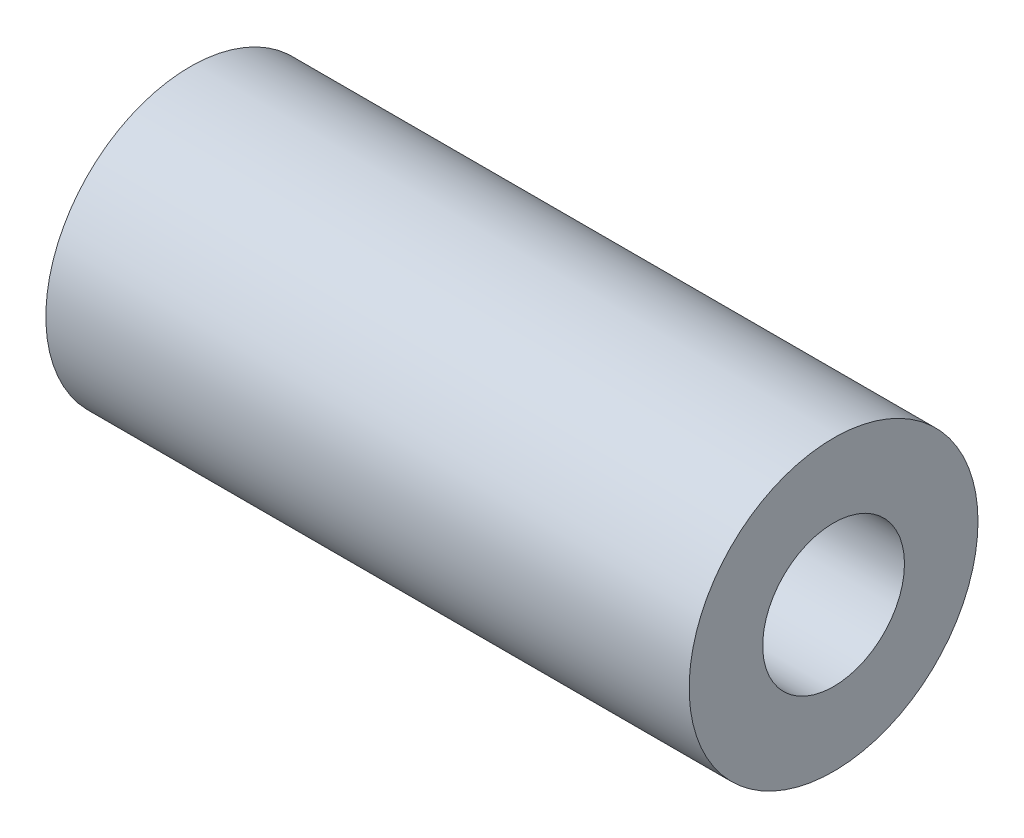
ISO-10303-21;
HEADER;
FILE_DESCRIPTION(('STEP AP214'),'2;1');
FILE_NAME('part.step','',(''),(''),'','','');
FILE_SCHEMA(('AUTOMOTIVE_DESIGN { 1 0 10303 214 1 1 1 1 }'));
ENDSEC;
DATA;
#1=APPLICATION_CONTEXT('core data for automotive mechanical design processes');
#2=APPLICATION_PROTOCOL_DEFINITION('international standard','automotive_design',2000,#1);
#3=PRODUCT_CONTEXT('',#1,'mechanical');
#4=PRODUCT('Part','Part','',(#3));
#5=PRODUCT_RELATED_PRODUCT_CATEGORY('part','',(#4));
#6=PRODUCT_DEFINITION_FORMATION('','',#4);
#7=PRODUCT_DEFINITION_CONTEXT('part definition',#1,'design');
#8=PRODUCT_DEFINITION('design','',#6,#7);
#9=PRODUCT_DEFINITION_SHAPE('','',#8);
#10=(LENGTH_UNIT() NAMED_UNIT(*) SI_UNIT(.MILLI.,.METRE.));
#11=(NAMED_UNIT(*) PLANE_ANGLE_UNIT() SI_UNIT($,.RADIAN.));
#12=(NAMED_UNIT(*) SI_UNIT($,.STERADIAN.) SOLID_ANGLE_UNIT());
#13=UNCERTAINTY_MEASURE_WITH_UNIT(LENGTH_MEASURE(1.E-05),#10,'distance_accuracy_value','');
#14=(GEOMETRIC_REPRESENTATION_CONTEXT(3) GLOBAL_UNCERTAINTY_ASSIGNED_CONTEXT((#13)) GLOBAL_UNIT_ASSIGNED_CONTEXT((#10,
#11,#12)) REPRESENTATION_CONTEXT('',''));
#15=CARTESIAN_POINT('',(0.,0.,0.));
#16=DIRECTION('',(0.,0.,1.));
#17=DIRECTION('',(1.,0.,0.));
#18=AXIS2_PLACEMENT_3D('',#15,#16,#17);
#19=CARTESIAN_POINT('',(24.5,0.,0.));
#20=DIRECTION('',(1.,0.,0.));
#21=DIRECTION('',(0.,0.,-1.));
#22=AXIS2_PLACEMENT_3D('',#19,#20,#21);
#23=PLANE('',#22);
#24=CARTESIAN_POINT('',(24.5,0.,0.));
#25=DIRECTION('',(1.,0.,0.));
#26=DIRECTION('',(0.,0.,-1.));
#27=AXIS2_PLACEMENT_3D('',#24,#25,#26);
#28=CIRCLE('',#27,5.5);
#29=CARTESIAN_POINT('',(24.5,0.,-5.5));
#30=VERTEX_POINT('',#29);
#31=EDGE_CURVE('E10',#30,#30,#28,.T.);
#32=ORIENTED_EDGE('',*,*,#31,.T.);
#33=EDGE_LOOP('',(#32));
#34=FACE_BOUND('',#33,.T.);
#35=CARTESIAN_POINT('',(24.5,0.,0.));
#36=DIRECTION('',(1.,0.,0.));
#37=DIRECTION('',(0.,0.,-1.));
#38=AXIS2_PLACEMENT_3D('',#35,#36,#37);
#39=CIRCLE('',#38,2.7);
#40=CARTESIAN_POINT('',(24.5,0.,-2.7));
#41=VERTEX_POINT('',#40);
#42=EDGE_CURVE('E42',#41,#41,#39,.T.);
#43=ORIENTED_EDGE('',*,*,#42,.F.);
#44=EDGE_LOOP('',(#43));
#45=FACE_BOUND('',#44,.T.);
#46=ADVANCED_FACE('F31',(#34,#45),#23,.T.);
#47=CARTESIAN_POINT('',(0.,0.,0.));
#48=DIRECTION('',(1.,0.,0.));
#49=DIRECTION('',(0.,0.,-1.));
#50=AXIS2_PLACEMENT_3D('',#47,#48,#49);
#51=PLANE('',#50);
#52=CARTESIAN_POINT('',(0.,0.,0.));
#53=DIRECTION('',(1.,0.,0.));
#54=DIRECTION('',(0.,0.,-1.));
#55=AXIS2_PLACEMENT_3D('',#52,#53,#54);
#56=CIRCLE('',#55,5.5);
#57=CARTESIAN_POINT('',(0.,0.,-5.5));
#58=VERTEX_POINT('',#57);
#59=EDGE_CURVE('E35',#58,#58,#56,.T.);
#60=ORIENTED_EDGE('',*,*,#59,.F.);
#61=EDGE_LOOP('',(#60));
#62=FACE_BOUND('',#61,.T.);
#63=CARTESIAN_POINT('',(0.,0.,0.));
#64=DIRECTION('',(1.,0.,0.));
#65=DIRECTION('',(0.,0.,-1.));
#66=AXIS2_PLACEMENT_3D('',#63,#64,#65);
#67=CIRCLE('',#66,2.7);
#68=CARTESIAN_POINT('',(0.,0.,-2.7));
#69=VERTEX_POINT('',#68);
#70=EDGE_CURVE('E44',#69,#69,#67,.T.);
#71=ORIENTED_EDGE('',*,*,#70,.T.);
#72=EDGE_LOOP('',(#71));
#73=FACE_BOUND('',#72,.T.);
#74=ADVANCED_FACE('F54',(#62,#73),#51,.F.);
#75=CARTESIAN_POINT('',(24.5,0.,0.));
#76=DIRECTION('',(-1.,0.,0.));
#77=DIRECTION('',(0.,0.,1.));
#78=AXIS2_PLACEMENT_3D('',#75,#76,#77);
#79=CYLINDRICAL_SURFACE('',#78,5.5);
#80=ORIENTED_EDGE('',*,*,#31,.F.);
#81=EDGE_LOOP('',(#80));
#82=FACE_BOUND('',#81,.T.);
#83=ORIENTED_EDGE('',*,*,#59,.T.);
#84=EDGE_LOOP('',(#83));
#85=FACE_BOUND('',#84,.T.);
#86=ADVANCED_FACE('F33',(#82,#85),#79,.T.);
#87=CARTESIAN_POINT('',(24.5,0.,0.));
#88=DIRECTION('',(-1.,0.,0.));
#89=DIRECTION('',(0.,0.,1.));
#90=AXIS2_PLACEMENT_3D('',#87,#88,#89);
#91=CYLINDRICAL_SURFACE('',#90,2.7);
#92=ORIENTED_EDGE('',*,*,#42,.T.);
#93=EDGE_LOOP('',(#92));
#94=FACE_BOUND('',#93,.T.);
#95=ORIENTED_EDGE('',*,*,#70,.F.);
#96=EDGE_LOOP('',(#95));
#97=FACE_BOUND('',#96,.T.);
#98=ADVANCED_FACE('F50',(#94,#97),#91,.F.);
#99=CLOSED_SHELL('',(#46,#74,#86,#98));
#100=MANIFOLD_SOLID_BREP('B2',#99);
#101=ADVANCED_BREP_SHAPE_REPRESENTATION('',(#18,#100),#14);
#102=SHAPE_DEFINITION_REPRESENTATION(#9,#101);
ENDSEC;
END-ISO-10303-21;
